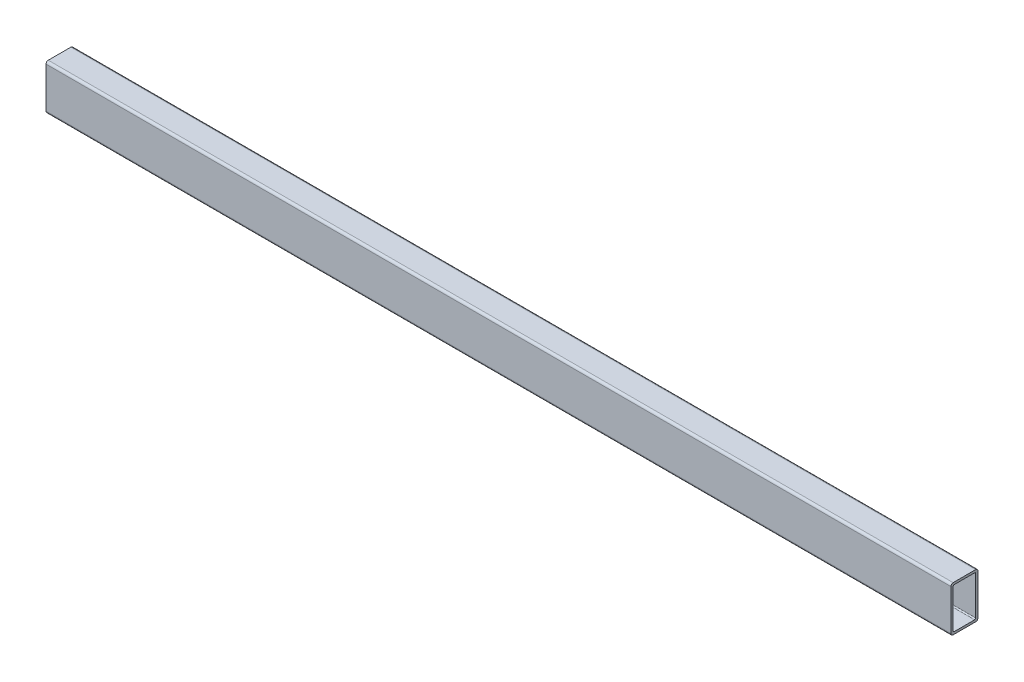
ISO-10303-21;
HEADER;
FILE_DESCRIPTION(('STEP AP214'),'2;1');
FILE_NAME('part.step','',(''),(''),'','','');
FILE_SCHEMA(('AUTOMOTIVE_DESIGN { 1 0 10303 214 1 1 1 1 }'));
ENDSEC;
DATA;
#1=APPLICATION_CONTEXT('core data for automotive mechanical design processes');
#2=APPLICATION_PROTOCOL_DEFINITION('international standard','automotive_design',2000,#1);
#3=PRODUCT_CONTEXT('',#1,'mechanical');
#4=PRODUCT('Part','Part','',(#3));
#5=PRODUCT_RELATED_PRODUCT_CATEGORY('part','',(#4));
#6=PRODUCT_DEFINITION_FORMATION('','',#4);
#7=PRODUCT_DEFINITION_CONTEXT('part definition',#1,'design');
#8=PRODUCT_DEFINITION('design','',#6,#7);
#9=PRODUCT_DEFINITION_SHAPE('','',#8);
#10=(LENGTH_UNIT() NAMED_UNIT(*) SI_UNIT(.MILLI.,.METRE.));
#11=(NAMED_UNIT(*) PLANE_ANGLE_UNIT() SI_UNIT($,.RADIAN.));
#12=(NAMED_UNIT(*) SI_UNIT($,.STERADIAN.) SOLID_ANGLE_UNIT());
#13=UNCERTAINTY_MEASURE_WITH_UNIT(LENGTH_MEASURE(1.E-05),#10,'distance_accuracy_value','');
#14=(GEOMETRIC_REPRESENTATION_CONTEXT(3) GLOBAL_UNCERTAINTY_ASSIGNED_CONTEXT((#13)) GLOBAL_UNIT_ASSIGNED_CONTEXT((#10,
#11,#12)) REPRESENTATION_CONTEXT('',''));
#15=CARTESIAN_POINT('',(0.,0.,0.));
#16=DIRECTION('',(0.,0.,1.));
#17=DIRECTION('',(1.,0.,0.));
#18=AXIS2_PLACEMENT_3D('',#15,#16,#17);
#19=CARTESIAN_POINT('',(2290.572,28.575,15.875));
#20=DIRECTION('',(-1.,0.,0.));
#21=DIRECTION('',(0.,0.,1.));
#22=AXIS2_PLACEMENT_3D('',#19,#20,#21);
#23=CYLINDRICAL_SURFACE('',#22,3.175);
#24=DIRECTION('',(1.,0.,0.));
#25=VECTOR('',#24,1.);
#26=CARTESIAN_POINT('',(-635.,31.75,15.875));
#27=LINE('',#26,#25);
#28=CARTESIAN_POINT('',(-635.,31.75,15.875));
#29=VERTEX_POINT('',#28);
#30=CARTESIAN_POINT('',(635.,31.75,15.875));
#31=VERTEX_POINT('',#30);
#32=EDGE_CURVE('E157',#29,#31,#27,.T.);
#33=ORIENTED_EDGE('',*,*,#32,.F.);
#34=CARTESIAN_POINT('',(-635.,28.575,15.875));
#35=DIRECTION('',(-1.,0.,0.));
#36=DIRECTION('',(0.,0.,1.));
#37=AXIS2_PLACEMENT_3D('',#34,#35,#36);
#38=CIRCLE('',#37,3.175);
#39=CARTESIAN_POINT('',(-635.,28.575,19.05));
#40=VERTEX_POINT('',#39);
#41=EDGE_CURVE('E185',#29,#40,#38,.F.);
#42=ORIENTED_EDGE('',*,*,#41,.T.);
#43=DIRECTION('',(1.,0.,0.));
#44=VECTOR('',#43,1.);
#45=CARTESIAN_POINT('',(-635.,28.575,19.05));
#46=LINE('',#45,#44);
#47=CARTESIAN_POINT('',(635.,28.575,19.05));
#48=VERTEX_POINT('',#47);
#49=EDGE_CURVE('E189',#48,#40,#46,.F.);
#50=ORIENTED_EDGE('',*,*,#49,.F.);
#51=CARTESIAN_POINT('',(635.,28.575,15.875));
#52=DIRECTION('',(-1.,0.,0.));
#53=DIRECTION('',(0.,0.,1.));
#54=AXIS2_PLACEMENT_3D('',#51,#52,#53);
#55=CIRCLE('',#54,3.175);
#56=EDGE_CURVE('E231',#31,#48,#55,.F.);
#57=ORIENTED_EDGE('',*,*,#56,.F.);
#58=EDGE_LOOP('',(#33,#42,#50,#57));
#59=FACE_BOUND('',#58,.T.);
#60=ADVANCED_FACE('F17',(#59),#23,.T.);
#61=CARTESIAN_POINT('',(-635.,31.75,19.05));
#62=DIRECTION('',(0.,0.,1.));
#63=DIRECTION('',(1.,0.,0.));
#64=AXIS2_PLACEMENT_3D('',#61,#62,#63);
#65=PLANE('',#64);
#66=DIRECTION('',(0.,1.,0.));
#67=VECTOR('',#66,1.);
#68=CARTESIAN_POINT('',(635.,0.,19.05));
#69=LINE('',#68,#67);
#70=CARTESIAN_POINT('',(635.,-28.575,19.05));
#71=VERTEX_POINT('',#70);
#72=EDGE_CURVE('E156',#48,#71,#69,.F.);
#73=ORIENTED_EDGE('',*,*,#72,.F.);
#74=ORIENTED_EDGE('',*,*,#49,.T.);
#75=DIRECTION('',(0.,1.,0.));
#76=VECTOR('',#75,1.);
#77=CARTESIAN_POINT('',(-635.,0.,19.05));
#78=LINE('',#77,#76);
#79=CARTESIAN_POINT('',(-635.,-28.575,19.05));
#80=VERTEX_POINT('',#79);
#81=EDGE_CURVE('E213',#40,#80,#78,.F.);
#82=ORIENTED_EDGE('',*,*,#81,.T.);
#83=DIRECTION('',(-1.,0.,0.));
#84=VECTOR('',#83,1.);
#85=CARTESIAN_POINT('',(2290.572,-28.575,19.05));
#86=LINE('',#85,#84);
#87=EDGE_CURVE('E128',#71,#80,#86,.T.);
#88=ORIENTED_EDGE('',*,*,#87,.F.);
#89=EDGE_LOOP('',(#73,#74,#82,#88));
#90=FACE_BOUND('',#89,.T.);
#91=ADVANCED_FACE('F435',(#90),#65,.T.);
#92=CARTESIAN_POINT('',(2290.572,-28.575,15.875));
#93=DIRECTION('',(-1.,0.,0.));
#94=DIRECTION('',(0.,0.,1.));
#95=AXIS2_PLACEMENT_3D('',#92,#93,#94);
#96=CYLINDRICAL_SURFACE('',#95,3.175);
#97=ORIENTED_EDGE('',*,*,#87,.T.);
#98=CARTESIAN_POINT('',(-635.,-28.575,15.875));
#99=DIRECTION('',(-1.,0.,0.));
#100=DIRECTION('',(0.,0.,1.));
#101=AXIS2_PLACEMENT_3D('',#98,#99,#100);
#102=CIRCLE('',#101,3.175);
#103=CARTESIAN_POINT('',(-635.,-31.75,15.875));
#104=VERTEX_POINT('',#103);
#105=EDGE_CURVE('E139',#80,#104,#102,.F.);
#106=ORIENTED_EDGE('',*,*,#105,.T.);
#107=DIRECTION('',(1.,0.,0.));
#108=VECTOR('',#107,1.);
#109=CARTESIAN_POINT('',(-635.,-31.75,15.875));
#110=LINE('',#109,#108);
#111=CARTESIAN_POINT('',(635.,-31.75,15.875));
#112=VERTEX_POINT('',#111);
#113=EDGE_CURVE('E133',#112,#104,#110,.F.);
#114=ORIENTED_EDGE('',*,*,#113,.F.);
#115=CARTESIAN_POINT('',(635.,-28.575,15.875));
#116=DIRECTION('',(-1.,0.,0.));
#117=DIRECTION('',(0.,0.,1.));
#118=AXIS2_PLACEMENT_3D('',#115,#116,#117);
#119=CIRCLE('',#118,3.175);
#120=EDGE_CURVE('E20',#71,#112,#119,.F.);
#121=ORIENTED_EDGE('',*,*,#120,.F.);
#122=EDGE_LOOP('',(#97,#106,#114,#121));
#123=FACE_BOUND('',#122,.T.);
#124=ADVANCED_FACE('F135',(#123),#96,.T.);
#125=CARTESIAN_POINT('',(-635.,-31.75,19.05));
#126=DIRECTION('',(0.,-1.,0.));
#127=DIRECTION('',(0.,0.,-1.));
#128=AXIS2_PLACEMENT_3D('',#125,#126,#127);
#129=PLANE('',#128);
#130=DIRECTION('',(0.,0.,-1.));
#131=VECTOR('',#130,1.);
#132=CARTESIAN_POINT('',(-635.,-31.75,0.));
#133=LINE('',#132,#131);
#134=CARTESIAN_POINT('',(-635.,-31.75,-15.875));
#135=VERTEX_POINT('',#134);
#136=EDGE_CURVE('E211',#104,#135,#133,.T.);
#137=ORIENTED_EDGE('',*,*,#136,.T.);
#138=DIRECTION('',(-1.,0.,0.));
#139=VECTOR('',#138,1.);
#140=CARTESIAN_POINT('',(2290.572,-31.75,-15.875));
#141=LINE('',#140,#139);
#142=CARTESIAN_POINT('',(635.,-31.75,-15.875));
#143=VERTEX_POINT('',#142);
#144=EDGE_CURVE('E148',#143,#135,#141,.T.);
#145=ORIENTED_EDGE('',*,*,#144,.F.);
#146=DIRECTION('',(0.,0.,-1.));
#147=VECTOR('',#146,1.);
#148=CARTESIAN_POINT('',(635.,-31.75,0.));
#149=LINE('',#148,#147);
#150=EDGE_CURVE('E145',#112,#143,#149,.T.);
#151=ORIENTED_EDGE('',*,*,#150,.F.);
#152=ORIENTED_EDGE('',*,*,#113,.T.);
#153=EDGE_LOOP('',(#137,#145,#151,#152));
#154=FACE_BOUND('',#153,.T.);
#155=ADVANCED_FACE('F146',(#154),#129,.T.);
#156=CARTESIAN_POINT('',(-635.,28.575,15.875));
#157=DIRECTION('',(0.,-1.,0.));
#158=DIRECTION('',(0.,0.,-1.));
#159=AXIS2_PLACEMENT_3D('',#156,#157,#158);
#160=PLANE('',#159);
#161=DIRECTION('',(0.,0.,-1.));
#162=VECTOR('',#161,1.);
#163=CARTESIAN_POINT('',(635.,28.575,0.));
#164=LINE('',#163,#162);
#165=CARTESIAN_POINT('',(635.,28.575,14.2875));
#166=VERTEX_POINT('',#165);
#167=CARTESIAN_POINT('',(635.,28.575,-14.2875));
#168=VERTEX_POINT('',#167);
#169=EDGE_CURVE('E220',#166,#168,#164,.T.);
#170=ORIENTED_EDGE('',*,*,#169,.F.);
#171=DIRECTION('',(1.,0.,0.));
#172=VECTOR('',#171,1.);
#173=CARTESIAN_POINT('',(-2290.572,28.575,14.2875));
#174=LINE('',#173,#172);
#175=CARTESIAN_POINT('',(-635.,28.575,14.2875));
#176=VERTEX_POINT('',#175);
#177=EDGE_CURVE('E168',#166,#176,#174,.F.);
#178=ORIENTED_EDGE('',*,*,#177,.T.);
#179=DIRECTION('',(0.,0.,-1.));
#180=VECTOR('',#179,1.);
#181=CARTESIAN_POINT('',(-635.,28.575,0.));
#182=LINE('',#181,#180);
#183=CARTESIAN_POINT('',(-635.,28.575,-14.2875));
#184=VERTEX_POINT('',#183);
#185=EDGE_CURVE('E207',#176,#184,#182,.T.);
#186=ORIENTED_EDGE('',*,*,#185,.T.);
#187=DIRECTION('',(1.,0.,0.));
#188=VECTOR('',#187,1.);
#189=CARTESIAN_POINT('',(-2290.572,28.575,-14.2875));
#190=LINE('',#189,#188);
#191=EDGE_CURVE('E142',#184,#168,#190,.T.);
#192=ORIENTED_EDGE('',*,*,#191,.T.);
#193=EDGE_LOOP('',(#170,#178,#186,#192));
#194=FACE_BOUND('',#193,.T.);
#195=ADVANCED_FACE('F275',(#194),#160,.T.);
#196=CARTESIAN_POINT('',(-2290.572,26.9875,-14.2875));
#197=DIRECTION('',(1.,0.,0.));
#198=DIRECTION('',(0.,0.,-1.));
#199=AXIS2_PLACEMENT_3D('',#196,#197,#198);
#200=CYLINDRICAL_SURFACE('',#199,1.5875);
#201=ORIENTED_EDGE('',*,*,#191,.F.);
#202=CARTESIAN_POINT('',(-635.,26.9875,-14.2875));
#203=DIRECTION('',(1.,0.,0.));
#204=DIRECTION('',(0.,0.,-1.));
#205=AXIS2_PLACEMENT_3D('',#202,#203,#204);
#206=CIRCLE('',#205,1.5875);
#207=CARTESIAN_POINT('',(-635.,26.9875,-15.875));
#208=VERTEX_POINT('',#207);
#209=EDGE_CURVE('E205',#184,#208,#206,.F.);
#210=ORIENTED_EDGE('',*,*,#209,.T.);
#211=DIRECTION('',(1.,0.,0.));
#212=VECTOR('',#211,1.);
#213=CARTESIAN_POINT('',(-635.,26.9875,-15.875));
#214=LINE('',#213,#212);
#215=CARTESIAN_POINT('',(635.,26.9875,-15.875));
#216=VERTEX_POINT('',#215);
#217=EDGE_CURVE('E181',#216,#208,#214,.F.);
#218=ORIENTED_EDGE('',*,*,#217,.F.);
#219=CARTESIAN_POINT('',(635.,26.9875,-14.2875));
#220=DIRECTION('',(1.,0.,0.));
#221=DIRECTION('',(0.,0.,-1.));
#222=AXIS2_PLACEMENT_3D('',#219,#220,#221);
#223=CIRCLE('',#222,1.5875);
#224=EDGE_CURVE('E217',#168,#216,#223,.F.);
#225=ORIENTED_EDGE('',*,*,#224,.F.);
#226=EDGE_LOOP('',(#201,#210,#218,#225));
#227=FACE_BOUND('',#226,.T.);
#228=ADVANCED_FACE('F278',(#227),#200,.F.);
#229=CARTESIAN_POINT('',(-635.,28.575,-15.875));
#230=DIRECTION('',(0.,0.,1.));
#231=DIRECTION('',(1.,0.,0.));
#232=AXIS2_PLACEMENT_3D('',#229,#230,#231);
#233=PLANE('',#232);
#234=DIRECTION('',(0.,1.,0.));
#235=VECTOR('',#234,1.);
#236=CARTESIAN_POINT('',(635.,0.,-15.875));
#237=LINE('',#236,#235);
#238=CARTESIAN_POINT('',(635.,-26.9875,-15.875));
#239=VERTEX_POINT('',#238);
#240=EDGE_CURVE('E216',#216,#239,#237,.F.);
#241=ORIENTED_EDGE('',*,*,#240,.F.);
#242=ORIENTED_EDGE('',*,*,#217,.T.);
#243=DIRECTION('',(0.,1.,0.));
#244=VECTOR('',#243,1.);
#245=CARTESIAN_POINT('',(-635.,0.,-15.875));
#246=LINE('',#245,#244);
#247=CARTESIAN_POINT('',(-635.,-26.9875,-15.875));
#248=VERTEX_POINT('',#247);
#249=EDGE_CURVE('E204',#208,#248,#246,.F.);
#250=ORIENTED_EDGE('',*,*,#249,.T.);
#251=DIRECTION('',(1.,0.,0.));
#252=VECTOR('',#251,1.);
#253=CARTESIAN_POINT('',(-2290.572,-26.9875,-15.875));
#254=LINE('',#253,#252);
#255=EDGE_CURVE('E179',#248,#239,#254,.T.);
#256=ORIENTED_EDGE('',*,*,#255,.T.);
#257=EDGE_LOOP('',(#241,#242,#250,#256));
#258=FACE_BOUND('',#257,.T.);
#259=ADVANCED_FACE('F295',(#258),#233,.T.);
#260=CARTESIAN_POINT('',(-2290.572,-26.9875,-14.2875));
#261=DIRECTION('',(1.,0.,0.));
#262=DIRECTION('',(0.,0.,-1.));
#263=AXIS2_PLACEMENT_3D('',#260,#261,#262);
#264=CYLINDRICAL_SURFACE('',#263,1.5875);
#265=ORIENTED_EDGE('',*,*,#255,.F.);
#266=CARTESIAN_POINT('',(-635.,-26.9875,-14.2875));
#267=DIRECTION('',(1.,0.,0.));
#268=DIRECTION('',(0.,0.,-1.));
#269=AXIS2_PLACEMENT_3D('',#266,#267,#268);
#270=CIRCLE('',#269,1.5875);
#271=CARTESIAN_POINT('',(-635.,-28.575,-14.2875));
#272=VERTEX_POINT('',#271);
#273=EDGE_CURVE('E202',#248,#272,#270,.F.);
#274=ORIENTED_EDGE('',*,*,#273,.T.);
#275=DIRECTION('',(1.,0.,0.));
#276=VECTOR('',#275,1.);
#277=CARTESIAN_POINT('',(-635.,-28.575,-14.2875));
#278=LINE('',#277,#276);
#279=CARTESIAN_POINT('',(635.,-28.575,-14.2875));
#280=VERTEX_POINT('',#279);
#281=EDGE_CURVE('E176',#280,#272,#278,.F.);
#282=ORIENTED_EDGE('',*,*,#281,.F.);
#283=CARTESIAN_POINT('',(635.,-26.9875,-14.2875));
#284=DIRECTION('',(1.,0.,0.));
#285=DIRECTION('',(0.,0.,-1.));
#286=AXIS2_PLACEMENT_3D('',#283,#284,#285);
#287=CIRCLE('',#286,1.5875);
#288=EDGE_CURVE('E229',#239,#280,#287,.F.);
#289=ORIENTED_EDGE('',*,*,#288,.F.);
#290=EDGE_LOOP('',(#265,#274,#282,#289));
#291=FACE_BOUND('',#290,.T.);
#292=ADVANCED_FACE('F293',(#291),#264,.F.);
#293=CARTESIAN_POINT('',(-635.,-28.575,-15.875));
#294=DIRECTION('',(0.,1.,0.));
#295=DIRECTION('',(0.,0.,1.));
#296=AXIS2_PLACEMENT_3D('',#293,#294,#295);
#297=PLANE('',#296);
#298=DIRECTION('',(0.,0.,-1.));
#299=VECTOR('',#298,1.);
#300=CARTESIAN_POINT('',(635.,-28.575,0.));
#301=LINE('',#300,#299);
#302=CARTESIAN_POINT('',(635.,-28.575,14.2875));
#303=VERTEX_POINT('',#302);
#304=EDGE_CURVE('E228',#280,#303,#301,.F.);
#305=ORIENTED_EDGE('',*,*,#304,.F.);
#306=ORIENTED_EDGE('',*,*,#281,.T.);
#307=DIRECTION('',(0.,0.,-1.));
#308=VECTOR('',#307,1.);
#309=CARTESIAN_POINT('',(-635.,-28.575,0.));
#310=LINE('',#309,#308);
#311=CARTESIAN_POINT('',(-635.,-28.575,14.2875));
#312=VERTEX_POINT('',#311);
#313=EDGE_CURVE('E201',#272,#312,#310,.F.);
#314=ORIENTED_EDGE('',*,*,#313,.T.);
#315=DIRECTION('',(1.,0.,0.));
#316=VECTOR('',#315,1.);
#317=CARTESIAN_POINT('',(-2290.572,-28.575,14.2875));
#318=LINE('',#317,#316);
#319=EDGE_CURVE('E174',#312,#303,#318,.T.);
#320=ORIENTED_EDGE('',*,*,#319,.T.);
#321=EDGE_LOOP('',(#305,#306,#314,#320));
#322=FACE_BOUND('',#321,.T.);
#323=ADVANCED_FACE('F289',(#322),#297,.T.);
#324=CARTESIAN_POINT('',(-2290.572,-26.9875,14.2875));
#325=DIRECTION('',(1.,0.,0.));
#326=DIRECTION('',(0.,0.,-1.));
#327=AXIS2_PLACEMENT_3D('',#324,#325,#326);
#328=CYLINDRICAL_SURFACE('',#327,1.5875);
#329=ORIENTED_EDGE('',*,*,#319,.F.);
#330=CARTESIAN_POINT('',(-635.,-26.9875,14.2875));
#331=DIRECTION('',(1.,0.,0.));
#332=DIRECTION('',(0.,0.,-1.));
#333=AXIS2_PLACEMENT_3D('',#330,#331,#332);
#334=CIRCLE('',#333,1.5875);
#335=CARTESIAN_POINT('',(-635.,-26.9875,15.875));
#336=VERTEX_POINT('',#335);
#337=EDGE_CURVE('E199',#312,#336,#334,.F.);
#338=ORIENTED_EDGE('',*,*,#337,.T.);
#339=DIRECTION('',(-1.,0.,0.));
#340=VECTOR('',#339,1.);
#341=CARTESIAN_POINT('',(-635.,-26.9875,15.875));
#342=LINE('',#341,#340);
#343=CARTESIAN_POINT('',(635.,-26.9875,15.875));
#344=VERTEX_POINT('',#343);
#345=EDGE_CURVE('E170',#344,#336,#342,.T.);
#346=ORIENTED_EDGE('',*,*,#345,.F.);
#347=CARTESIAN_POINT('',(635.,-26.9875,14.2875));
#348=DIRECTION('',(1.,0.,0.));
#349=DIRECTION('',(0.,0.,-1.));
#350=AXIS2_PLACEMENT_3D('',#347,#348,#349);
#351=CIRCLE('',#350,1.5875);
#352=EDGE_CURVE('E225',#303,#344,#351,.F.);
#353=ORIENTED_EDGE('',*,*,#352,.F.);
#354=EDGE_LOOP('',(#329,#338,#346,#353));
#355=FACE_BOUND('',#354,.T.);
#356=ADVANCED_FACE('F285',(#355),#328,.F.);
#357=CARTESIAN_POINT('',(-635.,-28.575,15.875));
#358=DIRECTION('',(0.,0.,-1.));
#359=DIRECTION('',(-1.,0.,0.));
#360=AXIS2_PLACEMENT_3D('',#357,#358,#359);
#361=PLANE('',#360);
#362=DIRECTION('',(0.,1.,0.));
#363=VECTOR('',#362,1.);
#364=CARTESIAN_POINT('',(-635.,0.,15.875));
#365=LINE('',#364,#363);
#366=CARTESIAN_POINT('',(-635.,26.9875,15.875));
#367=VERTEX_POINT('',#366);
#368=EDGE_CURVE('E198',#336,#367,#365,.T.);
#369=ORIENTED_EDGE('',*,*,#368,.T.);
#370=DIRECTION('',(1.,0.,0.));
#371=VECTOR('',#370,1.);
#372=CARTESIAN_POINT('',(-2290.572,26.9875,15.875));
#373=LINE('',#372,#371);
#374=CARTESIAN_POINT('',(635.,26.9875,15.875));
#375=VERTEX_POINT('',#374);
#376=EDGE_CURVE('E159',#367,#375,#373,.T.);
#377=ORIENTED_EDGE('',*,*,#376,.T.);
#378=DIRECTION('',(0.,1.,0.));
#379=VECTOR('',#378,1.);
#380=CARTESIAN_POINT('',(635.,0.,15.875));
#381=LINE('',#380,#379);
#382=EDGE_CURVE('E224',#344,#375,#381,.T.);
#383=ORIENTED_EDGE('',*,*,#382,.F.);
#384=ORIENTED_EDGE('',*,*,#345,.T.);
#385=EDGE_LOOP('',(#369,#377,#383,#384));
#386=FACE_BOUND('',#385,.T.);
#387=ADVANCED_FACE('F260',(#386),#361,.T.);
#388=CARTESIAN_POINT('',(-2290.572,26.9875,14.2875));
#389=DIRECTION('',(1.,0.,0.));
#390=DIRECTION('',(0.,0.,-1.));
#391=AXIS2_PLACEMENT_3D('',#388,#389,#390);
#392=CYLINDRICAL_SURFACE('',#391,1.5875);
#393=ORIENTED_EDGE('',*,*,#376,.F.);
#394=CARTESIAN_POINT('',(-635.,26.9875,14.2875));
#395=DIRECTION('',(1.,0.,0.));
#396=DIRECTION('',(0.,0.,-1.));
#397=AXIS2_PLACEMENT_3D('',#394,#395,#396);
#398=CIRCLE('',#397,1.5875);
#399=EDGE_CURVE('E167',#367,#176,#398,.F.);
#400=ORIENTED_EDGE('',*,*,#399,.T.);
#401=ORIENTED_EDGE('',*,*,#177,.F.);
#402=CARTESIAN_POINT('',(635.,26.9875,14.2875));
#403=DIRECTION('',(1.,0.,0.));
#404=DIRECTION('',(0.,0.,-1.));
#405=AXIS2_PLACEMENT_3D('',#402,#403,#404);
#406=CIRCLE('',#405,1.5875);
#407=EDGE_CURVE('E221',#375,#166,#406,.F.);
#408=ORIENTED_EDGE('',*,*,#407,.F.);
#409=EDGE_LOOP('',(#393,#400,#401,#408));
#410=FACE_BOUND('',#409,.T.);
#411=ADVANCED_FACE('F267',(#410),#392,.F.);
#412=CARTESIAN_POINT('',(-635.,31.75,-19.05));
#413=DIRECTION('',(0.,1.,0.));
#414=DIRECTION('',(0.,0.,1.));
#415=AXIS2_PLACEMENT_3D('',#412,#413,#414);
#416=PLANE('',#415);
#417=DIRECTION('',(0.,0.,-1.));
#418=VECTOR('',#417,1.);
#419=CARTESIAN_POINT('',(-635.,31.75,0.));
#420=LINE('',#419,#418);
#421=CARTESIAN_POINT('',(-635.,31.75,-15.875));
#422=VERTEX_POINT('',#421);
#423=EDGE_CURVE('E210',#422,#29,#420,.F.);
#424=ORIENTED_EDGE('',*,*,#423,.T.);
#425=ORIENTED_EDGE('',*,*,#32,.T.);
#426=DIRECTION('',(0.,0.,-1.));
#427=VECTOR('',#426,1.);
#428=CARTESIAN_POINT('',(635.,31.75,0.));
#429=LINE('',#428,#427);
#430=CARTESIAN_POINT('',(635.,31.75,-15.875));
#431=VERTEX_POINT('',#430);
#432=EDGE_CURVE('E151',#431,#31,#429,.F.);
#433=ORIENTED_EDGE('',*,*,#432,.F.);
#434=DIRECTION('',(-1.,0.,0.));
#435=VECTOR('',#434,1.);
#436=CARTESIAN_POINT('',(2290.572,31.75,-15.875));
#437=LINE('',#436,#435);
#438=EDGE_CURVE('E163',#422,#431,#437,.F.);
#439=ORIENTED_EDGE('',*,*,#438,.F.);
#440=EDGE_LOOP('',(#424,#425,#433,#439));
#441=FACE_BOUND('',#440,.T.);
#442=ADVANCED_FACE('F324',(#441),#416,.T.);
#443=CARTESIAN_POINT('',(635.,0.,0.));
#444=DIRECTION('',(1.,0.,0.));
#445=DIRECTION('',(0.,0.,-1.));
#446=AXIS2_PLACEMENT_3D('',#443,#444,#445);
#447=PLANE('',#446);
#448=ORIENTED_EDGE('',*,*,#224,.T.);
#449=ORIENTED_EDGE('',*,*,#240,.T.);
#450=ORIENTED_EDGE('',*,*,#288,.T.);
#451=ORIENTED_EDGE('',*,*,#304,.T.);
#452=ORIENTED_EDGE('',*,*,#352,.T.);
#453=ORIENTED_EDGE('',*,*,#382,.T.);
#454=ORIENTED_EDGE('',*,*,#407,.T.);
#455=ORIENTED_EDGE('',*,*,#169,.T.);
#456=EDGE_LOOP('',(#448,#449,#450,#451,#452,#453,#454,#455));
#457=FACE_BOUND('',#456,.T.);
#458=ORIENTED_EDGE('',*,*,#432,.T.);
#459=ORIENTED_EDGE('',*,*,#56,.T.);
#460=ORIENTED_EDGE('',*,*,#72,.T.);
#461=ORIENTED_EDGE('',*,*,#120,.T.);
#462=ORIENTED_EDGE('',*,*,#150,.T.);
#463=CARTESIAN_POINT('',(635.,-28.575,-15.875));
#464=DIRECTION('',(-1.,0.,0.));
#465=DIRECTION('',(0.,0.,1.));
#466=AXIS2_PLACEMENT_3D('',#463,#464,#465);
#467=CIRCLE('',#466,3.175);
#468=CARTESIAN_POINT('',(635.,-28.575,-19.05));
#469=VERTEX_POINT('',#468);
#470=EDGE_CURVE('E186',#469,#143,#467,.T.);
#471=ORIENTED_EDGE('',*,*,#470,.F.);
#472=DIRECTION('',(0.,1.,0.));
#473=VECTOR('',#472,1.);
#474=CARTESIAN_POINT('',(635.,-31.75,-19.05));
#475=LINE('',#474,#473);
#476=CARTESIAN_POINT('',(635.,28.575,-19.05));
#477=VERTEX_POINT('',#476);
#478=EDGE_CURVE('E193',#477,#469,#475,.F.);
#479=ORIENTED_EDGE('',*,*,#478,.F.);
#480=CARTESIAN_POINT('',(635.,28.575,-15.875));
#481=DIRECTION('',(-1.,0.,0.));
#482=DIRECTION('',(0.,0.,1.));
#483=AXIS2_PLACEMENT_3D('',#480,#481,#482);
#484=CIRCLE('',#483,3.175);
#485=EDGE_CURVE('E166',#431,#477,#484,.T.);
#486=ORIENTED_EDGE('',*,*,#485,.F.);
#487=EDGE_LOOP('',(#458,#459,#460,#461,#462,#471,#479,#486));
#488=FACE_BOUND('',#487,.T.);
#489=ADVANCED_FACE('F154',(#457,#488),#447,.T.);
#490=CARTESIAN_POINT('',(2290.572,-28.575,-15.875));
#491=DIRECTION('',(-1.,0.,0.));
#492=DIRECTION('',(0.,0.,1.));
#493=AXIS2_PLACEMENT_3D('',#490,#491,#492);
#494=CYLINDRICAL_SURFACE('',#493,3.175);
#495=ORIENTED_EDGE('',*,*,#144,.T.);
#496=CARTESIAN_POINT('',(-635.,-28.575,-15.875));
#497=DIRECTION('',(-1.,0.,0.));
#498=DIRECTION('',(0.,0.,1.));
#499=AXIS2_PLACEMENT_3D('',#496,#497,#498);
#500=CIRCLE('',#499,3.175);
#501=CARTESIAN_POINT('',(-635.,-28.575,-19.05));
#502=VERTEX_POINT('',#501);
#503=EDGE_CURVE('E208',#135,#502,#500,.F.);
#504=ORIENTED_EDGE('',*,*,#503,.T.);
#505=DIRECTION('',(-1.,0.,0.));
#506=VECTOR('',#505,1.);
#507=CARTESIAN_POINT('',(-635.,-28.575,-19.05));
#508=LINE('',#507,#506);
#509=EDGE_CURVE('E244',#469,#502,#508,.T.);
#510=ORIENTED_EDGE('',*,*,#509,.F.);
#511=ORIENTED_EDGE('',*,*,#470,.T.);
#512=EDGE_LOOP('',(#495,#504,#510,#511));
#513=FACE_BOUND('',#512,.T.);
#514=ADVANCED_FACE('F318',(#513),#494,.T.);
#515=CARTESIAN_POINT('',(-635.,0.,0.));
#516=DIRECTION('',(1.,0.,0.));
#517=DIRECTION('',(0.,0.,-1.));
#518=AXIS2_PLACEMENT_3D('',#515,#516,#517);
#519=PLANE('',#518);
#520=ORIENTED_EDGE('',*,*,#368,.F.);
#521=ORIENTED_EDGE('',*,*,#337,.F.);
#522=ORIENTED_EDGE('',*,*,#313,.F.);
#523=ORIENTED_EDGE('',*,*,#273,.F.);
#524=ORIENTED_EDGE('',*,*,#249,.F.);
#525=ORIENTED_EDGE('',*,*,#209,.F.);
#526=ORIENTED_EDGE('',*,*,#185,.F.);
#527=ORIENTED_EDGE('',*,*,#399,.F.);
#528=EDGE_LOOP('',(#520,#521,#522,#523,#524,#525,#526,#527));
#529=FACE_BOUND('',#528,.T.);
#530=CARTESIAN_POINT('',(-635.,28.575,-15.875));
#531=DIRECTION('',(-1.,0.,0.));
#532=DIRECTION('',(0.,0.,1.));
#533=AXIS2_PLACEMENT_3D('',#530,#531,#532);
#534=CIRCLE('',#533,3.175);
#535=CARTESIAN_POINT('',(-635.,28.575,-19.05));
#536=VERTEX_POINT('',#535);
#537=EDGE_CURVE('E35',#536,#422,#534,.F.);
#538=ORIENTED_EDGE('',*,*,#537,.F.);
#539=DIRECTION('',(0.,1.,0.));
#540=VECTOR('',#539,1.);
#541=CARTESIAN_POINT('',(-635.,-31.75,-19.05));
#542=LINE('',#541,#540);
#543=EDGE_CURVE('E26',#502,#536,#542,.T.);
#544=ORIENTED_EDGE('',*,*,#543,.F.);
#545=ORIENTED_EDGE('',*,*,#503,.F.);
#546=ORIENTED_EDGE('',*,*,#136,.F.);
#547=ORIENTED_EDGE('',*,*,#105,.F.);
#548=ORIENTED_EDGE('',*,*,#81,.F.);
#549=ORIENTED_EDGE('',*,*,#41,.F.);
#550=ORIENTED_EDGE('',*,*,#423,.F.);
#551=EDGE_LOOP('',(#538,#544,#545,#546,#547,#548,#549,#550));
#552=FACE_BOUND('',#551,.T.);
#553=ADVANCED_FACE('F269',(#529,#552),#519,.F.);
#554=CARTESIAN_POINT('',(2290.572,28.575,-15.875));
#555=DIRECTION('',(-1.,0.,0.));
#556=DIRECTION('',(0.,0.,1.));
#557=AXIS2_PLACEMENT_3D('',#554,#555,#556);
#558=CYLINDRICAL_SURFACE('',#557,3.175);
#559=DIRECTION('',(-1.,0.,0.));
#560=VECTOR('',#559,1.);
#561=CARTESIAN_POINT('',(-635.,28.575,-19.05));
#562=LINE('',#561,#560);
#563=EDGE_CURVE('E11',#536,#477,#562,.F.);
#564=ORIENTED_EDGE('',*,*,#563,.F.);
#565=ORIENTED_EDGE('',*,*,#537,.T.);
#566=ORIENTED_EDGE('',*,*,#438,.T.);
#567=ORIENTED_EDGE('',*,*,#485,.T.);
#568=EDGE_LOOP('',(#564,#565,#566,#567));
#569=FACE_BOUND('',#568,.T.);
#570=ADVANCED_FACE('F307',(#569),#558,.T.);
#571=CARTESIAN_POINT('',(-635.,-31.75,-19.05));
#572=DIRECTION('',(0.,0.,-1.));
#573=DIRECTION('',(-1.,0.,0.));
#574=AXIS2_PLACEMENT_3D('',#571,#572,#573);
#575=PLANE('',#574);
#576=ORIENTED_EDGE('',*,*,#543,.T.);
#577=ORIENTED_EDGE('',*,*,#563,.T.);
#578=ORIENTED_EDGE('',*,*,#478,.T.);
#579=ORIENTED_EDGE('',*,*,#509,.T.);
#580=EDGE_LOOP('',(#576,#577,#578,#579));
#581=FACE_BOUND('',#580,.T.);
#582=ADVANCED_FACE('F305',(#581),#575,.T.);
#583=CLOSED_SHELL('',(#60,#91,#124,#155,#195,#228,#259,#292,#323,#356,#387,#411,#442,#489,#514,
#553,#570,#582));
#584=MANIFOLD_SOLID_BREP('B1',#583);
#585=ADVANCED_BREP_SHAPE_REPRESENTATION('',(#18,#584),#14);
#586=SHAPE_DEFINITION_REPRESENTATION(#9,#585);
ENDSEC;
END-ISO-10303-21;
